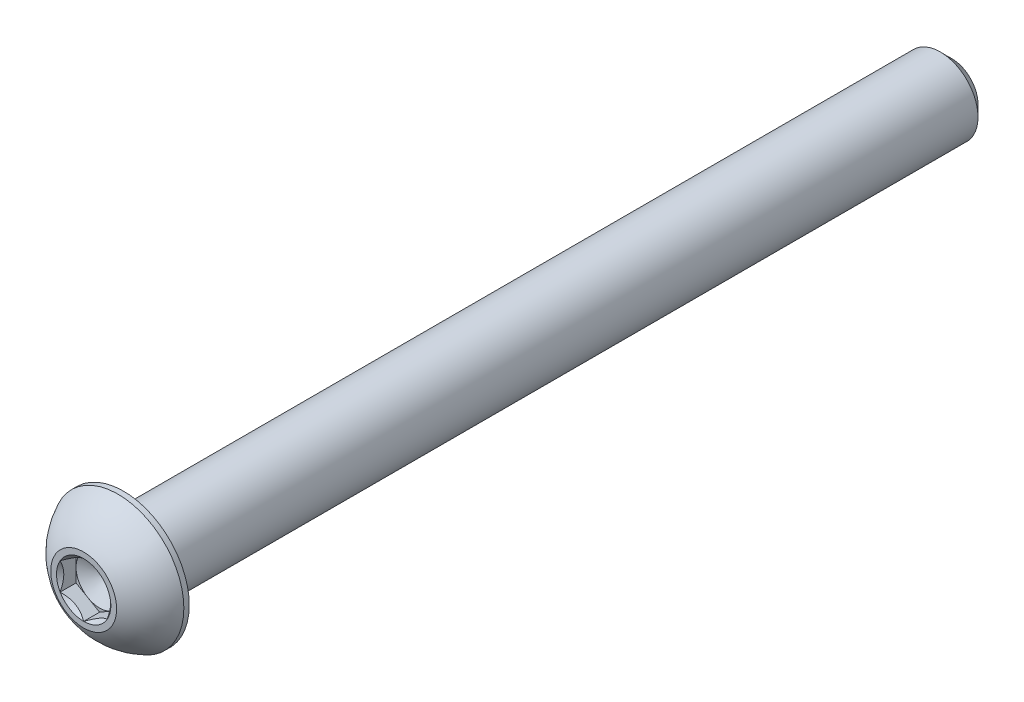
ISO-10303-21;
HEADER;
FILE_DESCRIPTION(('STEP AP214'),'2;1');
FILE_NAME('part.step','',(''),(''),'','','');
FILE_SCHEMA(('AUTOMOTIVE_DESIGN { 1 0 10303 214 1 1 1 1 }'));
ENDSEC;
DATA;
#1=APPLICATION_CONTEXT('core data for automotive mechanical design processes');
#2=APPLICATION_PROTOCOL_DEFINITION('international standard','automotive_design',2000,#1);
#3=PRODUCT_CONTEXT('',#1,'mechanical');
#4=PRODUCT('Part','Part','',(#3));
#5=PRODUCT_RELATED_PRODUCT_CATEGORY('part','',(#4));
#6=PRODUCT_DEFINITION_FORMATION('','',#4);
#7=PRODUCT_DEFINITION_CONTEXT('part definition',#1,'design');
#8=PRODUCT_DEFINITION('design','',#6,#7);
#9=PRODUCT_DEFINITION_SHAPE('','',#8);
#10=(LENGTH_UNIT() NAMED_UNIT(*) SI_UNIT(.MILLI.,.METRE.));
#11=(NAMED_UNIT(*) PLANE_ANGLE_UNIT() SI_UNIT($,.RADIAN.));
#12=(NAMED_UNIT(*) SI_UNIT($,.STERADIAN.) SOLID_ANGLE_UNIT());
#13=UNCERTAINTY_MEASURE_WITH_UNIT(LENGTH_MEASURE(1.E-05),#10,'distance_accuracy_value','');
#14=(GEOMETRIC_REPRESENTATION_CONTEXT(3) GLOBAL_UNCERTAINTY_ASSIGNED_CONTEXT((#13)) GLOBAL_UNIT_ASSIGNED_CONTEXT((#10,
#11,#12)) REPRESENTATION_CONTEXT('',''));
#15=CARTESIAN_POINT('',(0.,0.,0.));
#16=DIRECTION('',(0.,0.,1.));
#17=DIRECTION('',(1.,0.,0.));
#18=AXIS2_PLACEMENT_3D('',#15,#16,#17);
#19=CARTESIAN_POINT('',(0.,1.984375,36.6014));
#20=DIRECTION('',(0.,0.,-1.));
#21=DIRECTION('',(-1.,0.,0.));
#22=AXIS2_PLACEMENT_3D('',#19,#20,#21);
#23=PLANE('',#22);
#24=CARTESIAN_POINT('',(0.,0.,36.6014));
#25=DIRECTION('',(0.,0.,1.));
#26=DIRECTION('',(1.,0.,0.));
#27=AXIS2_PLACEMENT_3D('',#24,#25,#26);
#28=CIRCLE('',#27,2.778125);
#29=CARTESIAN_POINT('',(2.778125,0.,36.6014));
#30=VERTEX_POINT('',#29);
#31=EDGE_CURVE('E167',#30,#30,#28,.T.);
#32=ORIENTED_EDGE('',*,*,#31,.T.);
#33=EDGE_LOOP('',(#32));
#34=FACE_BOUND('',#33,.T.);
#35=CARTESIAN_POINT('',(0.,0.,36.6014));
#36=DIRECTION('',(0.,0.,1.));
#37=DIRECTION('',(1.,0.,0.));
#38=AXIS2_PLACEMENT_3D('',#35,#36,#37);
#39=CIRCLE('',#38,2.29135888084633);
#40=CARTESIAN_POINT('',(0.,2.29135888084633,36.6014));
#41=VERTEX_POINT('',#40);
#42=CARTESIAN_POINT('',(-1.984375,1.14567944042316,36.6014));
#43=VERTEX_POINT('',#42);
#44=EDGE_CURVE('E121',#41,#43,#39,.T.);
#45=ORIENTED_EDGE('',*,*,#44,.F.);
#46=CARTESIAN_POINT('',(0.,0.,36.6014));
#47=DIRECTION('',(0.,0.,1.));
#48=DIRECTION('',(1.,0.,0.));
#49=AXIS2_PLACEMENT_3D('',#46,#47,#48);
#50=CIRCLE('',#49,2.29135888084633);
#51=CARTESIAN_POINT('',(1.984375,1.14567944042317,36.6014));
#52=VERTEX_POINT('',#51);
#53=EDGE_CURVE('E106',#52,#41,#50,.T.);
#54=ORIENTED_EDGE('',*,*,#53,.F.);
#55=CARTESIAN_POINT('',(0.,0.,36.6014));
#56=DIRECTION('',(0.,0.,1.));
#57=DIRECTION('',(1.,0.,0.));
#58=AXIS2_PLACEMENT_3D('',#55,#56,#57);
#59=CIRCLE('',#58,2.29135888084633);
#60=CARTESIAN_POINT('',(1.984375,-1.14567944042316,36.6014));
#61=VERTEX_POINT('',#60);
#62=EDGE_CURVE('E117',#61,#52,#59,.T.);
#63=ORIENTED_EDGE('',*,*,#62,.F.);
#64=CARTESIAN_POINT('',(0.,0.,36.6014));
#65=DIRECTION('',(0.,0.,1.));
#66=DIRECTION('',(1.,0.,0.));
#67=AXIS2_PLACEMENT_3D('',#64,#65,#66);
#68=CIRCLE('',#67,2.29135888084633);
#69=CARTESIAN_POINT('',(0.,-2.29135888084633,36.6014));
#70=VERTEX_POINT('',#69);
#71=EDGE_CURVE('E138',#70,#61,#68,.T.);
#72=ORIENTED_EDGE('',*,*,#71,.F.);
#73=CARTESIAN_POINT('',(0.,0.,36.6014));
#74=DIRECTION('',(0.,0.,1.));
#75=DIRECTION('',(1.,0.,0.));
#76=AXIS2_PLACEMENT_3D('',#73,#74,#75);
#77=CIRCLE('',#76,2.29135888084633);
#78=CARTESIAN_POINT('',(-1.984375,-1.14567944042316,36.6014));
#79=VERTEX_POINT('',#78);
#80=EDGE_CURVE('E438',#79,#70,#77,.T.);
#81=ORIENTED_EDGE('',*,*,#80,.F.);
#82=CARTESIAN_POINT('',(0.,0.,36.6014));
#83=DIRECTION('',(0.,0.,1.));
#84=DIRECTION('',(1.,0.,0.));
#85=AXIS2_PLACEMENT_3D('',#82,#83,#84);
#86=CIRCLE('',#85,2.29135888084633);
#87=EDGE_CURVE('E447',#43,#79,#86,.T.);
#88=ORIENTED_EDGE('',*,*,#87,.F.);
#89=EDGE_LOOP('',(#45,#54,#63,#72,#81,#88));
#90=FACE_BOUND('',#89,.T.);
#91=ADVANCED_FACE('F33',(#34,#90),#23,.F.);
#92=CARTESIAN_POINT('',(0.,0.,-36.6014));
#93=DIRECTION('',(0.,0.,1.));
#94=DIRECTION('',(1.,0.,0.));
#95=AXIS2_PLACEMENT_3D('',#92,#93,#94);
#96=CONICAL_SURFACE('',#95,2.2225,0.78539816339745);
#97=CARTESIAN_POINT('',(0.,0.,-35.6489));
#98=DIRECTION('',(0.,0.,1.));
#99=DIRECTION('',(1.,0.,0.));
#100=AXIS2_PLACEMENT_3D('',#97,#98,#99);
#101=CIRCLE('',#100,3.175);
#102=CARTESIAN_POINT('',(3.175,0.,-35.6489));
#103=VERTEX_POINT('',#102);
#104=EDGE_CURVE('E11',#103,#103,#101,.T.);
#105=ORIENTED_EDGE('',*,*,#104,.F.);
#106=EDGE_LOOP('',(#105));
#107=FACE_BOUND('',#106,.T.);
#108=CARTESIAN_POINT('',(0.,0.,-36.6014));
#109=DIRECTION('',(0.,0.,1.));
#110=DIRECTION('',(1.,0.,0.));
#111=AXIS2_PLACEMENT_3D('',#108,#109,#110);
#112=CIRCLE('',#111,2.2225);
#113=CARTESIAN_POINT('',(2.2225,0.,-36.6014));
#114=VERTEX_POINT('',#113);
#115=EDGE_CURVE('E160',#114,#114,#112,.T.);
#116=ORIENTED_EDGE('',*,*,#115,.T.);
#117=EDGE_LOOP('',(#116));
#118=FACE_BOUND('',#117,.T.);
#119=ADVANCED_FACE('F35',(#107,#118),#96,.T.);
#120=CARTESIAN_POINT('',(0.,0.,36.6014));
#121=DIRECTION('',(0.,0.,1.));
#122=DIRECTION('',(1.,0.,0.));
#123=AXIS2_PLACEMENT_3D('',#120,#121,#122);
#124=CYLINDRICAL_SURFACE('',#123,3.175);
#125=CARTESIAN_POINT('',(0.,0.,33.2486));
#126=DIRECTION('',(0.,0.,1.));
#127=DIRECTION('',(1.,0.,0.));
#128=AXIS2_PLACEMENT_3D('',#125,#126,#127);
#129=CIRCLE('',#128,3.175);
#130=CARTESIAN_POINT('',(3.175,0.,33.2486));
#131=VERTEX_POINT('',#130);
#132=EDGE_CURVE('E41',#131,#131,#129,.T.);
#133=ORIENTED_EDGE('',*,*,#132,.F.);
#134=EDGE_LOOP('',(#133));
#135=FACE_BOUND('',#134,.T.);
#136=ORIENTED_EDGE('',*,*,#104,.T.);
#137=EDGE_LOOP('',(#136));
#138=FACE_BOUND('',#137,.T.);
#139=ADVANCED_FACE('F181',(#135,#138),#124,.T.);
#140=CARTESIAN_POINT('',(0.,5.5499,33.2486));
#141=DIRECTION('',(0.,0.,1.));
#142=DIRECTION('',(1.,0.,0.));
#143=AXIS2_PLACEMENT_3D('',#140,#141,#142);
#144=PLANE('',#143);
#145=CARTESIAN_POINT('',(0.,0.,33.2486));
#146=DIRECTION('',(0.,0.,1.));
#147=DIRECTION('',(1.,0.,0.));
#148=AXIS2_PLACEMENT_3D('',#145,#146,#147);
#149=CIRCLE('',#148,5.5499);
#150=CARTESIAN_POINT('',(5.5499,0.,33.2486));
#151=VERTEX_POINT('',#150);
#152=EDGE_CURVE('E174',#151,#151,#149,.T.);
#153=ORIENTED_EDGE('',*,*,#152,.F.);
#154=EDGE_LOOP('',(#153));
#155=FACE_BOUND('',#154,.T.);
#156=ORIENTED_EDGE('',*,*,#132,.T.);
#157=EDGE_LOOP('',(#156));
#158=FACE_BOUND('',#157,.T.);
#159=ADVANCED_FACE('F179',(#155,#158),#144,.F.);
#160=CARTESIAN_POINT('',(0.,0.,36.6014));
#161=DIRECTION('',(0.,0.,1.));
#162=DIRECTION('',(1.,0.,0.));
#163=AXIS2_PLACEMENT_3D('',#160,#161,#162);
#164=CYLINDRICAL_SURFACE('',#163,5.5499);
#165=CARTESIAN_POINT('',(0.,0.,33.7021714285714));
#166=DIRECTION('',(0.,0.,1.));
#167=DIRECTION('',(1.,0.,0.));
#168=AXIS2_PLACEMENT_3D('',#165,#166,#167);
#169=CIRCLE('',#168,5.5499);
#170=CARTESIAN_POINT('',(5.5499,0.,33.7021714285714));
#171=VERTEX_POINT('',#170);
#172=EDGE_CURVE('E171',#171,#171,#169,.T.);
#173=ORIENTED_EDGE('',*,*,#172,.F.);
#174=EDGE_LOOP('',(#173));
#175=FACE_BOUND('',#174,.T.);
#176=ORIENTED_EDGE('',*,*,#152,.T.);
#177=EDGE_LOOP('',(#176));
#178=FACE_BOUND('',#177,.T.);
#179=ADVANCED_FACE('F200',(#175,#178),#164,.T.);
#180=CARTESIAN_POINT('',(0.,0.,31.1708282068545));
#181=DIRECTION('',(0.,0.,1.));
#182=DIRECTION('',(0.,1.,0.));
#183=AXIS2_PLACEMENT_3D('',#180,#181,#182);
#184=SPHERICAL_SURFACE('',#183,6.09992528775001);
#185=ORIENTED_EDGE('',*,*,#31,.F.);
#186=EDGE_LOOP('',(#185));
#187=FACE_BOUND('',#186,.T.);
#188=ORIENTED_EDGE('',*,*,#172,.T.);
#189=EDGE_LOOP('',(#188));
#190=FACE_BOUND('',#189,.T.);
#191=ADVANCED_FACE('F192',(#187,#190),#184,.T.);
#192=CARTESIAN_POINT('',(0.,2.2225,-36.6014));
#193=DIRECTION('',(0.,0.,1.));
#194=DIRECTION('',(1.,0.,0.));
#195=AXIS2_PLACEMENT_3D('',#192,#193,#194);
#196=PLANE('',#195);
#197=ORIENTED_EDGE('',*,*,#115,.F.);
#198=EDGE_LOOP('',(#197));
#199=FACE_BOUND('',#198,.T.);
#200=ADVANCED_FACE('F190',(#199),#196,.F.);
#201=CARTESIAN_POINT('',(1.984375,1.14567944042317,36.6014));
#202=DIRECTION('',(-0.499999999999999,-0.866025403784439,0.));
#203=DIRECTION('',(0.866025403784439,-0.499999999999999,0.));
#204=AXIS2_PLACEMENT_3D('',#201,#202,#203);
#205=PLANE('',#204);
#206=CARTESIAN_POINT('',(1.984575,1.14556397036933,36.6015154787818));
#207=CARTESIAN_POINT('',(1.9163590048332,1.18494849354192,36.5621628522639));
#208=CARTESIAN_POINT('',(1.84700231489303,1.22499159714897,36.5251213104462));
#209=CARTESIAN_POINT('',(1.70557619954781,1.30664400291398,36.4572988584233));
#210=CARTESIAN_POINT('',(1.63349332126322,1.34826107209555,36.4265556890917));
#211=CARTESIAN_POINT('',(1.488141602734,1.43217992591557,36.3738918888112));
#212=CARTESIAN_POINT('',(1.41490978751306,1.47446033414663,36.35183887588));
#213=CARTESIAN_POINT('',(1.26683381740529,1.55995203534886,36.3178614929439));
#214=CARTESIAN_POINT('',(1.19199418724657,1.60316071596705,36.3059117560917));
#215=CARTESIAN_POINT('',(1.06301458545618,1.6776271237807,36.2951300990819));
#216=CARTESIAN_POINT('',(1.00904128422755,1.70878862377411,36.2935338990591));
#217=CARTESIAN_POINT('',(0.901182881480193,1.77106070163466,36.2962218388653));
#218=CARTESIAN_POINT('',(0.84729781751447,1.80217125782057,36.3005080403405));
#219=CARTESIAN_POINT('',(0.740036461751389,1.86409863044402,36.3147168730135));
#220=CARTESIAN_POINT('',(0.686660807239853,1.89491507894443,36.3246458104523));
#221=CARTESIAN_POINT('',(0.580832482591097,1.95601509066828,36.3495950842745));
#222=CARTESIAN_POINT('',(0.528379742028891,1.9862986945516,36.3646150303895));
#223=CARTESIAN_POINT('',(0.394017661036345,2.06387267818153,36.4092078516357));
#224=CARTESIAN_POINT('',(0.312941642841671,2.11068193911104,36.4421429959383));
#225=CARTESIAN_POINT('',(0.193726693270158,2.17951072233758,36.4977424412022));
#226=CARTESIAN_POINT('',(0.154440075613998,2.20219286161692,36.5172775920519));
#227=CARTESIAN_POINT('',(0.0765946381319478,2.24713694590236,36.5581287381194));
#228=CARTESIAN_POINT('',(0.0380353888983014,2.26939913882716,36.5794436395683));
#229=CARTESIAN_POINT('',(-0.000199999999999745,2.29147435090016,36.6015154787818));
#230=B_SPLINE_CURVE_WITH_KNOTS('',3,(#206,#207,#208,#209,#210,#211,#212,#213,#214,#215,#216,
#217,#218,#219,#220,#221,#222,#223,#224,#225,#226,#227,#228,#229),.UNSPECIFIED.,.F.,.F.,(4,2,2,
2,2,2,2,2,2,2,2,4),(0.,0.264339630306623,0.530219665093693,0.791876416371462,1.0528742441811,
1.23963984393201,1.42647091743853,1.61351120244035,1.80053715247541,2.09764209964317,
2.24579179873713,2.39385111134157),.UNSPECIFIED.);
#231=EDGE_CURVE('E103',#52,#41,#230,.T.);
#232=ORIENTED_EDGE('',*,*,#231,.T.);
#233=DIRECTION('',(0.,0.,-1.));
#234=VECTOR('',#233,1.);
#235=CARTESIAN_POINT('',(0.,2.29135888084633,36.6014));
#236=LINE('',#235,#234);
#237=CARTESIAN_POINT('',(0.,2.29135888084633,35.26028));
#238=VERTEX_POINT('',#237);
#239=EDGE_CURVE('E158',#41,#238,#236,.T.);
#240=ORIENTED_EDGE('',*,*,#239,.T.);
#241=DIRECTION('',(-0.866025403784439,0.499999999999999,0.));
#242=VECTOR('',#241,1.);
#243=CARTESIAN_POINT('',(1.984375,1.14567944042317,35.26028));
#244=LINE('',#243,#242);
#245=CARTESIAN_POINT('',(0.992187499999999,1.71851916063475,35.26028));
#246=VERTEX_POINT('',#245);
#247=EDGE_CURVE('E474',#246,#238,#244,.T.);
#248=ORIENTED_EDGE('',*,*,#247,.F.);
#249=CARTESIAN_POINT('',(1.984375,1.14567944042317,35.26028));
#250=VERTEX_POINT('',#249);
#251=EDGE_CURVE('E48',#250,#246,#244,.T.);
#252=ORIENTED_EDGE('',*,*,#251,.F.);
#253=DIRECTION('',(0.,0.,-1.));
#254=VECTOR('',#253,1.);
#255=CARTESIAN_POINT('',(1.984375,1.14567944042317,36.6014));
#256=LINE('',#255,#254);
#257=EDGE_CURVE('E134',#52,#250,#256,.T.);
#258=ORIENTED_EDGE('',*,*,#257,.F.);
#259=EDGE_LOOP('',(#232,#240,#248,#252,#258));
#260=FACE_BOUND('',#259,.T.);
#261=ADVANCED_FACE('F140',(#260),#205,.T.);
#262=CARTESIAN_POINT('',(0.,2.29135888084633,36.6014));
#263=DIRECTION('',(0.5,-0.866025403784438,0.));
#264=DIRECTION('',(0.866025403784438,0.5,0.));
#265=AXIS2_PLACEMENT_3D('',#262,#263,#264);
#266=PLANE('',#265);
#267=CARTESIAN_POINT('',(0.000199999999998038,2.29147435090017,36.6015154787818));
#268=CARTESIAN_POINT('',(-0.0680159951668046,2.25208982772757,36.5621628522639));
#269=CARTESIAN_POINT('',(-0.137372685106967,2.21204672412052,36.5251213104462));
#270=CARTESIAN_POINT('',(-0.278798800452188,2.13039431835551,36.4572988584233));
#271=CARTESIAN_POINT('',(-0.350881678736783,2.08877724917394,36.4265556890917));
#272=CARTESIAN_POINT('',(-0.496233397266005,2.00485839535392,36.3738918888112));
#273=CARTESIAN_POINT('',(-0.569465212486941,1.96257798712287,36.35183887588));
#274=CARTESIAN_POINT('',(-0.717541182594711,1.87708628592063,36.3178614929439));
#275=CARTESIAN_POINT('',(-0.79238081275343,1.83387760530244,36.3059117560917));
#276=CARTESIAN_POINT('',(-0.921360414543822,1.75941119748879,36.2951300990819));
#277=CARTESIAN_POINT('',(-0.975333715772448,1.72824969749539,36.2935338990591));
#278=CARTESIAN_POINT('',(-1.08319211851981,1.66597761963484,36.2962218388653));
#279=CARTESIAN_POINT('',(-1.13707718248553,1.63486706344893,36.3005080403405));
#280=CARTESIAN_POINT('',(-1.24433853824861,1.57293969082547,36.3147168730135));
#281=CARTESIAN_POINT('',(-1.29771419276015,1.54212324232506,36.3246458104523));
#282=CARTESIAN_POINT('',(-1.4035425174089,1.48102323060121,36.3495950842745));
#283=CARTESIAN_POINT('',(-1.45599525797111,1.45073962671789,36.3646150303895));
#284=CARTESIAN_POINT('',(-1.59035733896365,1.37316564308797,36.4092078516357));
#285=CARTESIAN_POINT('',(-1.67143335715833,1.32635638215845,36.4421429959383));
#286=CARTESIAN_POINT('',(-1.79064830672984,1.25752759893191,36.4977424412022));
#287=CARTESIAN_POINT('',(-1.829934924386,1.23484545965257,36.5172775920519));
#288=CARTESIAN_POINT('',(-1.90778036186805,1.18990137536713,36.5581287381194));
#289=CARTESIAN_POINT('',(-1.9463396111017,1.16763918244233,36.5794436395683));
#290=CARTESIAN_POINT('',(-1.984575,1.14556397036933,36.6015154787818));
#291=B_SPLINE_CURVE_WITH_KNOTS('',3,(#267,#268,#269,#270,#271,#272,#273,#274,#275,#276,#277,
#278,#279,#280,#281,#282,#283,#284,#285,#286,#287,#288,#289,#290),.UNSPECIFIED.,.F.,.F.,(4,2,2,
2,2,2,2,2,2,2,2,4),(0.,0.264339630306623,0.530219665093693,0.791876416371462,1.0528742441811,
1.23963984393201,1.42647091743853,1.61351120244035,1.80053715247541,2.09764209964316,
2.24579179873713,2.39385111134157),.UNSPECIFIED.);
#292=EDGE_CURVE('E462',#41,#43,#291,.T.);
#293=ORIENTED_EDGE('',*,*,#292,.T.);
#294=DIRECTION('',(0.,0.,-1.));
#295=VECTOR('',#294,1.);
#296=CARTESIAN_POINT('',(-1.984375,1.14567944042316,36.6014));
#297=LINE('',#296,#295);
#298=CARTESIAN_POINT('',(-1.984375,1.14567944042316,35.26028));
#299=VERTEX_POINT('',#298);
#300=EDGE_CURVE('E155',#43,#299,#297,.T.);
#301=ORIENTED_EDGE('',*,*,#300,.T.);
#302=DIRECTION('',(-0.866025403784438,-0.5,0.));
#303=VECTOR('',#302,1.);
#304=CARTESIAN_POINT('',(0.,2.29135888084633,35.26028));
#305=LINE('',#304,#303);
#306=CARTESIAN_POINT('',(-0.992187500000001,1.71851916063475,35.26028));
#307=VERTEX_POINT('',#306);
#308=EDGE_CURVE('E476',#307,#299,#305,.T.);
#309=ORIENTED_EDGE('',*,*,#308,.F.);
#310=EDGE_CURVE('E477',#238,#307,#305,.T.);
#311=ORIENTED_EDGE('',*,*,#310,.F.);
#312=ORIENTED_EDGE('',*,*,#239,.F.);
#313=EDGE_LOOP('',(#293,#301,#309,#311,#312));
#314=FACE_BOUND('',#313,.T.);
#315=ADVANCED_FACE('F198',(#314),#266,.T.);
#316=CARTESIAN_POINT('',(-1.984375,1.14567944042316,36.6014));
#317=DIRECTION('',(1.,0.,0.));
#318=DIRECTION('',(0.,1.,0.));
#319=AXIS2_PLACEMENT_3D('',#316,#317,#318);
#320=PLANE('',#319);
#321=CARTESIAN_POINT('',(-1.984375,-2.24664989492636,37.3075700833169));
#322=CARTESIAN_POINT('',(-1.984375,-2.19177035879914,37.2664466992886));
#323=CARTESIAN_POINT('',(-1.984375,-2.1365793309425,37.2257329661326));
#324=CARTESIAN_POINT('',(-1.984375,-2.0254530694156,37.1453048670617));
#325=CARTESIAN_POINT('',(-1.984375,-1.96951764844329,37.1055907602265));
#326=CARTESIAN_POINT('',(-1.984375,-1.85637247000972,37.0270599960499));
#327=CARTESIAN_POINT('',(-1.984375,-1.79915619451492,36.9882526850202));
#328=CARTESIAN_POINT('',(-1.984375,-1.68374612486123,36.9121311665578));
#329=CARTESIAN_POINT('',(-1.984375,-1.62555240093273,36.8748168524981));
#330=CARTESIAN_POINT('',(-1.984375,-1.44283684202776,36.761567942359));
#331=CARTESIAN_POINT('',(-1.984375,-1.31636516124235,36.6887214191006));
#332=CARTESIAN_POINT('',(-1.984375,-1.05716498260296,36.5557117557776));
#333=CARTESIAN_POINT('',(-1.984375,-0.924459462264121,36.4955059196546));
#334=CARTESIAN_POINT('',(-1.984375,-0.724893074141585,36.4218618396154));
#335=CARTESIAN_POINT('',(-1.984375,-0.66090757224881,36.4006629174856));
#336=CARTESIAN_POINT('',(-1.984375,-0.531425551080245,36.3634071147974));
#337=CARTESIAN_POINT('',(-1.984375,-0.465928924835294,36.3473505994633));
#338=CARTESIAN_POINT('',(-1.984375,-0.334891945890405,36.3214708434592));
#339=CARTESIAN_POINT('',(-1.984375,-0.269372555502921,36.3115431015484));
#340=CARTESIAN_POINT('',(-1.984375,-0.137675185771462,36.2981085903106));
#341=CARTESIAN_POINT('',(-1.984375,-0.0714973135780648,36.2946007929468));
#342=CARTESIAN_POINT('',(-1.984375,0.0586431546448461,36.2942516482373));
#343=CARTESIAN_POINT('',(-1.984375,0.122605247687117,36.2971896245911));
#344=CARTESIAN_POINT('',(-1.984375,0.249962419599663,36.3090917091826));
#345=CARTESIAN_POINT('',(-1.984375,0.31335744162457,36.3180564148524));
#346=CARTESIAN_POINT('',(-1.984375,0.440194078343455,36.3416811503476));
#347=CARTESIAN_POINT('',(-1.984375,0.503617615772965,36.3564367997364));
#348=CARTESIAN_POINT('',(-1.984375,0.62908370104763,36.3908707574727));
#349=CARTESIAN_POINT('',(-1.984375,0.691126376772749,36.410548607898));
#350=CARTESIAN_POINT('',(-1.984375,0.888252191671365,36.4804251863326));
#351=CARTESIAN_POINT('',(-1.984375,1.02048040542615,36.5386555893404));
#352=CARTESIAN_POINT('',(-1.984375,1.27871806100267,36.6680691802767));
#353=CARTESIAN_POINT('',(-1.984375,1.40470281207756,36.7392992719574));
#354=CARTESIAN_POINT('',(-1.984375,1.58677859920221,36.8504129319412));
#355=CARTESIAN_POINT('',(-1.984375,1.64484387516129,36.8871238248926));
#356=CARTESIAN_POINT('',(-1.984375,1.75997827817989,36.9620874476375));
#357=CARTESIAN_POINT('',(-1.984375,1.81704732901584,37.0003402946748));
#358=CARTESIAN_POINT('',(-1.984375,1.92985499213404,37.0777867819938));
#359=CARTESIAN_POINT('',(-1.984375,1.98560066211378,37.1169701932287));
#360=CARTESIAN_POINT('',(-1.984375,2.09633159947627,37.1963666099261));
#361=CARTESIAN_POINT('',(-1.984375,2.15131707145809,37.2365793297131));
#362=CARTESIAN_POINT('',(-1.984375,2.20598450458983,37.27721347261));
#363=B_SPLINE_CURVE_WITH_KNOTS('',3,(#321,#322,#323,#324,#325,#326,#327,#328,#329,#330,#331,
#332,#333,#334,#335,#336,#337,#338,#339,#340,#341,#342,#343,#344,#345,#346,#347,#348,#349,#350,
#351,#352,#353,#354,#355,#356,#357,#358,#359,#360,#361,#362),.UNSPECIFIED.,.F.,.F.,(4,2,2,2,2,2,
2,2,2,2,2,2,2,2,2,2,2,2,2,2,4),(0.,0.20573621035677,0.411525204809811,0.618909845914794,
0.826279649489807,1.26374370453551,1.69970549535383,1.90175047418287,2.10380979948049,
2.3023211047986,2.50080061937433,2.69259135253524,2.88440110079442,3.07952109080018,
3.27462293514803,3.7067989701189,4.14056631296022,4.34663769336144,4.55272477227101,
4.7571295110882,4.96147812147719),.UNSPECIFIED.);
#364=EDGE_CURVE('E455',#43,#79,#363,.F.);
#365=ORIENTED_EDGE('',*,*,#364,.T.);
#366=DIRECTION('',(0.,0.,-1.));
#367=VECTOR('',#366,1.);
#368=CARTESIAN_POINT('',(-1.984375,-1.14567944042316,36.6014));
#369=LINE('',#368,#367);
#370=CARTESIAN_POINT('',(-1.984375,-1.14567944042316,35.26028));
#371=VERTEX_POINT('',#370);
#372=EDGE_CURVE('E152',#79,#371,#369,.T.);
#373=ORIENTED_EDGE('',*,*,#372,.T.);
#374=DIRECTION('',(0.,-1.,0.));
#375=VECTOR('',#374,1.);
#376=CARTESIAN_POINT('',(-1.984375,1.14567944042316,35.26028));
#377=LINE('',#376,#375);
#378=CARTESIAN_POINT('',(-1.984375,0.,35.26028));
#379=VERTEX_POINT('',#378);
#380=EDGE_CURVE('E480',#379,#371,#377,.T.);
#381=ORIENTED_EDGE('',*,*,#380,.F.);
#382=EDGE_CURVE('E481',#299,#379,#377,.T.);
#383=ORIENTED_EDGE('',*,*,#382,.F.);
#384=ORIENTED_EDGE('',*,*,#300,.F.);
#385=EDGE_LOOP('',(#365,#373,#381,#383,#384));
#386=FACE_BOUND('',#385,.T.);
#387=ADVANCED_FACE('F319',(#386),#320,.T.);
#388=CARTESIAN_POINT('',(-1.984375,-1.14567944042316,36.6014));
#389=DIRECTION('',(0.499999999999999,0.866025403784439,0.));
#390=DIRECTION('',(-0.866025403784439,0.499999999999999,0.));
#391=AXIS2_PLACEMENT_3D('',#388,#389,#390);
#392=PLANE('',#391);
#393=CARTESIAN_POINT('',(-1.984575,-1.14556397036933,36.6015154787818));
#394=CARTESIAN_POINT('',(-1.9163590048332,-1.18494849354192,36.5621628522639));
#395=CARTESIAN_POINT('',(-1.84700231489303,-1.22499159714897,36.5251213104462));
#396=CARTESIAN_POINT('',(-1.70557619954781,-1.30664400291398,36.4572988584233));
#397=CARTESIAN_POINT('',(-1.63349332126321,-1.34826107209555,36.4265556890917));
#398=CARTESIAN_POINT('',(-1.48814160273399,-1.43217992591557,36.3738918888112));
#399=CARTESIAN_POINT('',(-1.41490978751306,-1.47446033414663,36.35183887588));
#400=CARTESIAN_POINT('',(-1.26683381740529,-1.55995203534886,36.3178614929439));
#401=CARTESIAN_POINT('',(-1.19199418724657,-1.60316071596705,36.3059117560917));
#402=CARTESIAN_POINT('',(-1.06301458545618,-1.6776271237807,36.2951300990819));
#403=CARTESIAN_POINT('',(-1.00904128422755,-1.7087886237741,36.2935338990591));
#404=CARTESIAN_POINT('',(-0.901182881480194,-1.77106070163465,36.2962218388653));
#405=CARTESIAN_POINT('',(-0.847297817514471,-1.80217125782056,36.3005080403404));
#406=CARTESIAN_POINT('',(-0.74003646175139,-1.86409863044402,36.3147168730135));
#407=CARTESIAN_POINT('',(-0.686660807239854,-1.89491507894443,36.3246458104523));
#408=CARTESIAN_POINT('',(-0.580832482591098,-1.95601509066828,36.3495950842745));
#409=CARTESIAN_POINT('',(-0.528379742028893,-1.9862986945516,36.3646150303895));
#410=CARTESIAN_POINT('',(-0.394017661036347,-2.06387267818152,36.4092078516357));
#411=CARTESIAN_POINT('',(-0.312941642841672,-2.11068193911104,36.4421429959383));
#412=CARTESIAN_POINT('',(-0.193726693270161,-2.17951072233758,36.4977424412022));
#413=CARTESIAN_POINT('',(-0.154440075614,-2.20219286161692,36.5172775920519));
#414=CARTESIAN_POINT('',(-0.0765946381319494,-2.24713694590236,36.5581287381194));
#415=CARTESIAN_POINT('',(-0.0380353888983026,-2.26939913882716,36.5794436395683));
#416=CARTESIAN_POINT('',(0.000200000000000592,-2.29147435090016,36.6015154787818));
#417=B_SPLINE_CURVE_WITH_KNOTS('',3,(#393,#394,#395,#396,#397,#398,#399,#400,#401,#402,#403,
#404,#405,#406,#407,#408,#409,#410,#411,#412,#413,#414,#415,#416),.UNSPECIFIED.,.F.,.F.,(4,2,2,
2,2,2,2,2,2,2,2,4),(0.,0.264339630306631,0.530219665093698,0.791876416371465,1.0528742441811,
1.23963984393201,1.42647091743853,1.61351120244035,1.80053715247541,2.09764209964316,
2.24579179873713,2.39385111134157),.UNSPECIFIED.);
#418=EDGE_CURVE('E440',#79,#70,#417,.T.);
#419=ORIENTED_EDGE('',*,*,#418,.T.);
#420=DIRECTION('',(0.,0.,-1.));
#421=VECTOR('',#420,1.);
#422=CARTESIAN_POINT('',(0.,-2.29135888084633,36.6014));
#423=LINE('',#422,#421);
#424=CARTESIAN_POINT('',(0.,-2.29135888084633,35.26028));
#425=VERTEX_POINT('',#424);
#426=EDGE_CURVE('E143',#70,#425,#423,.T.);
#427=ORIENTED_EDGE('',*,*,#426,.T.);
#428=DIRECTION('',(0.866025403784439,-0.499999999999999,0.));
#429=VECTOR('',#428,1.);
#430=CARTESIAN_POINT('',(-1.984375,-1.14567944042316,35.26028));
#431=LINE('',#430,#429);
#432=CARTESIAN_POINT('',(-0.992187499999998,-1.71851916063475,35.26028));
#433=VERTEX_POINT('',#432);
#434=EDGE_CURVE('E484',#433,#425,#431,.T.);
#435=ORIENTED_EDGE('',*,*,#434,.F.);
#436=EDGE_CURVE('E485',#371,#433,#431,.T.);
#437=ORIENTED_EDGE('',*,*,#436,.F.);
#438=ORIENTED_EDGE('',*,*,#372,.F.);
#439=EDGE_LOOP('',(#419,#427,#435,#437,#438));
#440=FACE_BOUND('',#439,.T.);
#441=ADVANCED_FACE('F329',(#440),#392,.T.);
#442=CARTESIAN_POINT('',(0.,-2.29135888084633,36.6014));
#443=DIRECTION('',(-0.5,0.866025403784438,0.));
#444=DIRECTION('',(-0.866025403784438,-0.5,0.));
#445=AXIS2_PLACEMENT_3D('',#442,#443,#444);
#446=PLANE('',#445);
#447=CARTESIAN_POINT('',(-0.000199999999998923,-2.29147435090016,36.6015154787818));
#448=CARTESIAN_POINT('',(0.0680159951668029,-2.25208982772757,36.5621628522639));
#449=CARTESIAN_POINT('',(0.137372685106967,-2.21204672412052,36.5251213104462));
#450=CARTESIAN_POINT('',(0.278798800452189,-2.13039431835551,36.4572988584233));
#451=CARTESIAN_POINT('',(0.350881678736784,-2.08877724917394,36.4265556890917));
#452=CARTESIAN_POINT('',(0.496233397266005,-2.00485839535392,36.3738918888112));
#453=CARTESIAN_POINT('',(0.569465212486939,-1.96257798712286,36.35183887588));
#454=CARTESIAN_POINT('',(0.717541182594706,-1.87708628592063,36.3178614929439));
#455=CARTESIAN_POINT('',(0.792380812753423,-1.83387760530244,36.3059117560917));
#456=CARTESIAN_POINT('',(0.921360414543814,-1.75941119748879,36.2951300990819));
#457=CARTESIAN_POINT('',(0.97533371577244,-1.72824969749539,36.2935338990591));
#458=CARTESIAN_POINT('',(1.0831921185198,-1.66597761963484,36.2962218388653));
#459=CARTESIAN_POINT('',(1.13707718248552,-1.63486706344893,36.3005080403404));
#460=CARTESIAN_POINT('',(1.2443385382486,-1.57293969082547,36.3147168730135));
#461=CARTESIAN_POINT('',(1.29771419276014,-1.54212324232506,36.3246458104523));
#462=CARTESIAN_POINT('',(1.40354251740889,-1.48102323060122,36.3495950842745));
#463=CARTESIAN_POINT('',(1.4559952579711,-1.45073962671789,36.3646150303895));
#464=CARTESIAN_POINT('',(1.59035733896365,-1.37316564308797,36.4092078516357));
#465=CARTESIAN_POINT('',(1.67143335715832,-1.32635638215845,36.4421429959383));
#466=CARTESIAN_POINT('',(1.79064830672984,-1.25752759893191,36.4977424412022));
#467=CARTESIAN_POINT('',(1.829934924386,-1.23484545965257,36.5172775920519));
#468=CARTESIAN_POINT('',(1.90778036186805,-1.18990137536713,36.5581287381194));
#469=CARTESIAN_POINT('',(1.9463396111017,-1.16763918244233,36.5794436395683));
#470=CARTESIAN_POINT('',(1.984575,-1.14556397036932,36.6015154787818));
#471=B_SPLINE_CURVE_WITH_KNOTS('',3,(#447,#448,#449,#450,#451,#452,#453,#454,#455,#456,#457,
#458,#459,#460,#461,#462,#463,#464,#465,#466,#467,#468,#469,#470),.UNSPECIFIED.,.F.,.F.,(4,2,2,
2,2,2,2,2,2,2,2,4),(0.,0.264339630306629,0.530219665093695,0.791876416371459,1.05287424418109,
1.239639843932,1.42647091743852,1.61351120244034,1.8005371524754,2.09764209964316,
2.24579179873713,2.39385111134157),.UNSPECIFIED.);
#472=EDGE_CURVE('E431',#70,#61,#471,.T.);
#473=ORIENTED_EDGE('',*,*,#472,.T.);
#474=DIRECTION('',(0.,0.,-1.));
#475=VECTOR('',#474,1.);
#476=CARTESIAN_POINT('',(1.984375,-1.14567944042316,36.6014));
#477=LINE('',#476,#475);
#478=CARTESIAN_POINT('',(1.984375,-1.14567944042316,35.26028));
#479=VERTEX_POINT('',#478);
#480=EDGE_CURVE('E137',#61,#479,#477,.T.);
#481=ORIENTED_EDGE('',*,*,#480,.T.);
#482=DIRECTION('',(0.866025403784438,0.5,0.));
#483=VECTOR('',#482,1.);
#484=CARTESIAN_POINT('',(0.,-2.29135888084633,35.26028));
#485=LINE('',#484,#483);
#486=CARTESIAN_POINT('',(0.9921875,-1.71851916063474,35.26028));
#487=VERTEX_POINT('',#486);
#488=EDGE_CURVE('E487',#487,#479,#485,.T.);
#489=ORIENTED_EDGE('',*,*,#488,.F.);
#490=EDGE_CURVE('E488',#425,#487,#485,.T.);
#491=ORIENTED_EDGE('',*,*,#490,.F.);
#492=ORIENTED_EDGE('',*,*,#426,.F.);
#493=EDGE_LOOP('',(#473,#481,#489,#491,#492));
#494=FACE_BOUND('',#493,.T.);
#495=ADVANCED_FACE('F339',(#494),#446,.T.);
#496=CARTESIAN_POINT('',(1.984375,-1.14567944042316,36.6014));
#497=DIRECTION('',(-1.,0.,0.));
#498=DIRECTION('',(0.,-1.,0.));
#499=AXIS2_PLACEMENT_3D('',#496,#497,#498);
#500=PLANE('',#499);
#501=CARTESIAN_POINT('',(1.984375,-2.24664989492635,37.3075700833169));
#502=CARTESIAN_POINT('',(1.984375,-2.19177035879913,37.2664466992886));
#503=CARTESIAN_POINT('',(1.984375,-2.1365793309425,37.2257329661326));
#504=CARTESIAN_POINT('',(1.984375,-2.0254530694156,37.1453048670617));
#505=CARTESIAN_POINT('',(1.984375,-1.96951764844329,37.1055907602265));
#506=CARTESIAN_POINT('',(1.984375,-1.85637247000971,37.0270599960499));
#507=CARTESIAN_POINT('',(1.984375,-1.79915619451491,36.9882526850202));
#508=CARTESIAN_POINT('',(1.984375,-1.68374612486123,36.9121311665578));
#509=CARTESIAN_POINT('',(1.984375,-1.62555240093272,36.8748168524981));
#510=CARTESIAN_POINT('',(1.984375,-1.44283684202776,36.761567942359));
#511=CARTESIAN_POINT('',(1.984375,-1.31636516124235,36.6887214191006));
#512=CARTESIAN_POINT('',(1.984375,-1.05716498260295,36.5557117557776));
#513=CARTESIAN_POINT('',(1.984375,-0.924459462264117,36.4955059196546));
#514=CARTESIAN_POINT('',(1.984375,-0.724893074141585,36.4218618396154));
#515=CARTESIAN_POINT('',(1.984375,-0.66090757224881,36.4006629174856));
#516=CARTESIAN_POINT('',(1.984375,-0.531425551080245,36.3634071147974));
#517=CARTESIAN_POINT('',(1.984375,-0.465928924835292,36.3473505994633));
#518=CARTESIAN_POINT('',(1.984375,-0.334891945890402,36.3214708434592));
#519=CARTESIAN_POINT('',(1.984375,-0.269372555502918,36.3115431015484));
#520=CARTESIAN_POINT('',(1.984375,-0.137675185771458,36.2981085903106));
#521=CARTESIAN_POINT('',(1.984375,-0.0714973135780599,36.2946007929468));
#522=CARTESIAN_POINT('',(1.984375,0.0586431546448513,36.2942516482373));
#523=CARTESIAN_POINT('',(1.984375,0.122605247687121,36.2971896245911));
#524=CARTESIAN_POINT('',(1.984375,0.249962419599666,36.3090917091826));
#525=CARTESIAN_POINT('',(1.984375,0.313357441624572,36.3180564148524));
#526=CARTESIAN_POINT('',(1.984375,0.440194078343456,36.3416811503476));
#527=CARTESIAN_POINT('',(1.984375,0.503617615772966,36.3564367997364));
#528=CARTESIAN_POINT('',(1.984375,0.62908370104763,36.3908707574727));
#529=CARTESIAN_POINT('',(1.984375,0.691126376772749,36.410548607898));
#530=CARTESIAN_POINT('',(1.984375,0.888252191671362,36.4804251863326));
#531=CARTESIAN_POINT('',(1.984375,1.02048040542615,36.5386555893404));
#532=CARTESIAN_POINT('',(1.984375,1.27871806100267,36.6680691802767));
#533=CARTESIAN_POINT('',(1.984375,1.40470281207756,36.7392992719574));
#534=CARTESIAN_POINT('',(1.984375,1.5867785992022,36.8504129319412));
#535=CARTESIAN_POINT('',(1.984375,1.64484387516129,36.8871238248926));
#536=CARTESIAN_POINT('',(1.984375,1.75997827817988,36.9620874476374));
#537=CARTESIAN_POINT('',(1.984375,1.81704732901584,37.0003402946748));
#538=CARTESIAN_POINT('',(1.984375,1.92985499213404,37.0777867819938));
#539=CARTESIAN_POINT('',(1.984375,1.98560066211378,37.1169701932287));
#540=CARTESIAN_POINT('',(1.984375,2.09633159947627,37.1963666099261));
#541=CARTESIAN_POINT('',(1.984375,2.15131707145809,37.2365793297131));
#542=CARTESIAN_POINT('',(1.984375,2.20598450458983,37.27721347261));
#543=B_SPLINE_CURVE_WITH_KNOTS('',3,(#501,#502,#503,#504,#505,#506,#507,#508,#509,#510,#511,
#512,#513,#514,#515,#516,#517,#518,#519,#520,#521,#522,#523,#524,#525,#526,#527,#528,#529,#530,
#531,#532,#533,#534,#535,#536,#537,#538,#539,#540,#541,#542),.UNSPECIFIED.,.F.,.F.,(4,2,2,2,2,2,
2,2,2,2,2,2,2,2,2,2,2,2,2,2,4),(0.,0.205736210356761,0.411525204809804,0.618909845914792,
0.826279649489803,1.26374370453551,1.69970549535382,1.90175047418286,2.10380979948048,
2.30232110479859,2.50080061937433,2.69259135253523,2.88440110079441,3.07952109080017,
3.27462293514802,3.70679897011888,4.14056631296021,4.34663769336142,4.552724772271,
4.75712951108819,4.96147812147718),.UNSPECIFIED.);
#544=EDGE_CURVE('E127',#61,#52,#543,.T.);
#545=ORIENTED_EDGE('',*,*,#544,.T.);
#546=ORIENTED_EDGE('',*,*,#257,.T.);
#547=DIRECTION('',(0.,1.,0.));
#548=VECTOR('',#547,1.);
#549=CARTESIAN_POINT('',(1.984375,-1.14567944042316,35.26028));
#550=LINE('',#549,#548);
#551=CARTESIAN_POINT('',(1.984375,0.,35.26028));
#552=VERTEX_POINT('',#551);
#553=EDGE_CURVE('E146',#552,#250,#550,.T.);
#554=ORIENTED_EDGE('',*,*,#553,.F.);
#555=EDGE_CURVE('E141',#479,#552,#550,.T.);
#556=ORIENTED_EDGE('',*,*,#555,.F.);
#557=ORIENTED_EDGE('',*,*,#480,.F.);
#558=EDGE_LOOP('',(#545,#546,#554,#556,#557));
#559=FACE_BOUND('',#558,.T.);
#560=ADVANCED_FACE('F132',(#559),#500,.T.);
#561=CARTESIAN_POINT('',(0.,0.,35.26028));
#562=DIRECTION('',(0.,0.,1.));
#563=DIRECTION('',(1.,0.,0.));
#564=AXIS2_PLACEMENT_3D('',#561,#562,#563);
#565=PLANE('',#564);
#566=CARTESIAN_POINT('',(0.,0.,35.26028));
#567=DIRECTION('',(0.,0.,1.));
#568=DIRECTION('',(1.,0.,0.));
#569=AXIS2_PLACEMENT_3D('',#566,#567,#568);
#570=CIRCLE('',#569,1.984375);
#571=EDGE_CURVE('E163',#487,#552,#570,.T.);
#572=ORIENTED_EDGE('',*,*,#571,.F.);
#573=ORIENTED_EDGE('',*,*,#488,.T.);
#574=ORIENTED_EDGE('',*,*,#555,.T.);
#575=EDGE_LOOP('',(#572,#573,#574));
#576=FACE_BOUND('',#575,.T.);
#577=ADVANCED_FACE('F241',(#576),#565,.T.);
#578=EDGE_CURVE('E500',#433,#487,#570,.T.);
#579=ORIENTED_EDGE('',*,*,#578,.F.);
#580=ORIENTED_EDGE('',*,*,#434,.T.);
#581=ORIENTED_EDGE('',*,*,#490,.T.);
#582=EDGE_LOOP('',(#579,#580,#581));
#583=FACE_BOUND('',#582,.T.);
#584=ADVANCED_FACE('F246',(#583),#565,.T.);
#585=EDGE_CURVE('E501',#379,#433,#570,.T.);
#586=ORIENTED_EDGE('',*,*,#585,.F.);
#587=ORIENTED_EDGE('',*,*,#380,.T.);
#588=ORIENTED_EDGE('',*,*,#436,.T.);
#589=EDGE_LOOP('',(#586,#587,#588));
#590=FACE_BOUND('',#589,.T.);
#591=ADVANCED_FACE('F259',(#590),#565,.T.);
#592=EDGE_CURVE('E502',#307,#379,#570,.T.);
#593=ORIENTED_EDGE('',*,*,#592,.F.);
#594=ORIENTED_EDGE('',*,*,#308,.T.);
#595=ORIENTED_EDGE('',*,*,#382,.T.);
#596=EDGE_LOOP('',(#593,#594,#595));
#597=FACE_BOUND('',#596,.T.);
#598=ADVANCED_FACE('F268',(#597),#565,.T.);
#599=EDGE_CURVE('E168',#246,#307,#570,.T.);
#600=ORIENTED_EDGE('',*,*,#599,.F.);
#601=ORIENTED_EDGE('',*,*,#247,.T.);
#602=ORIENTED_EDGE('',*,*,#310,.T.);
#603=EDGE_LOOP('',(#600,#601,#602));
#604=FACE_BOUND('',#603,.T.);
#605=ADVANCED_FACE('F277',(#604),#565,.T.);
#606=EDGE_CURVE('E164',#552,#246,#570,.T.);
#607=ORIENTED_EDGE('',*,*,#606,.F.);
#608=ORIENTED_EDGE('',*,*,#553,.T.);
#609=ORIENTED_EDGE('',*,*,#251,.T.);
#610=EDGE_LOOP('',(#607,#608,#609));
#611=FACE_BOUND('',#610,.T.);
#612=ADVANCED_FACE('F249',(#611),#565,.T.);
#613=CARTESIAN_POINT('',(0.,0.,35.26028));
#614=DIRECTION('',(0.,0.,1.));
#615=DIRECTION('',(1.,0.,0.));
#616=AXIS2_PLACEMENT_3D('',#613,#614,#615);
#617=CONICAL_SURFACE('',#616,1.984375,1.0471975511966);
#618=CARTESIAN_POINT('',(0.,0.,34.1146005595768));
#619=VERTEX_POINT('',#618);
#620=VERTEX_LOOP('',#619);
#621=FACE_BOUND('',#620,.T.);
#622=ORIENTED_EDGE('',*,*,#606,.T.);
#623=ORIENTED_EDGE('',*,*,#599,.T.);
#624=ORIENTED_EDGE('',*,*,#592,.T.);
#625=ORIENTED_EDGE('',*,*,#585,.T.);
#626=ORIENTED_EDGE('',*,*,#578,.T.);
#627=ORIENTED_EDGE('',*,*,#571,.T.);
#628=EDGE_LOOP('',(#622,#623,#624,#625,#626,#627));
#629=FACE_BOUND('',#628,.T.);
#630=ADVANCED_FACE('F209',(#621,#629),#617,.F.);
#631=CARTESIAN_POINT('',(0.,0.,36.6014));
#632=DIRECTION('',(0.,0.,1.));
#633=DIRECTION('',(1.,0.,0.));
#634=AXIS2_PLACEMENT_3D('',#631,#632,#633);
#635=CONICAL_SURFACE('',#634,2.29135888084633,0.78539816339745);
#636=ORIENTED_EDGE('',*,*,#44,.T.);
#637=ORIENTED_EDGE('',*,*,#292,.F.);
#638=EDGE_LOOP('',(#636,#637));
#639=FACE_BOUND('',#638,.T.);
#640=ADVANCED_FACE('F300',(#639),#635,.F.);
#641=CARTESIAN_POINT('',(0.,0.,36.6014));
#642=DIRECTION('',(0.,0.,1.));
#643=DIRECTION('',(1.,0.,0.));
#644=AXIS2_PLACEMENT_3D('',#641,#642,#643);
#645=CONICAL_SURFACE('',#644,2.29135888084633,0.78539816339745);
#646=ORIENTED_EDGE('',*,*,#87,.T.);
#647=ORIENTED_EDGE('',*,*,#364,.F.);
#648=EDGE_LOOP('',(#646,#647));
#649=FACE_BOUND('',#648,.T.);
#650=ADVANCED_FACE('F362',(#649),#645,.F.);
#651=CARTESIAN_POINT('',(0.,0.,36.6014));
#652=DIRECTION('',(0.,0.,1.));
#653=DIRECTION('',(1.,0.,0.));
#654=AXIS2_PLACEMENT_3D('',#651,#652,#653);
#655=CONICAL_SURFACE('',#654,2.29135888084633,0.78539816339745);
#656=ORIENTED_EDGE('',*,*,#80,.T.);
#657=ORIENTED_EDGE('',*,*,#418,.F.);
#658=EDGE_LOOP('',(#656,#657));
#659=FACE_BOUND('',#658,.T.);
#660=ADVANCED_FACE('F372',(#659),#655,.F.);
#661=CARTESIAN_POINT('',(0.,0.,36.6014));
#662=DIRECTION('',(0.,0.,1.));
#663=DIRECTION('',(1.,0.,0.));
#664=AXIS2_PLACEMENT_3D('',#661,#662,#663);
#665=CONICAL_SURFACE('',#664,2.29135888084633,0.78539816339745);
#666=ORIENTED_EDGE('',*,*,#71,.T.);
#667=ORIENTED_EDGE('',*,*,#472,.F.);
#668=EDGE_LOOP('',(#666,#667));
#669=FACE_BOUND('',#668,.T.);
#670=ADVANCED_FACE('F382',(#669),#665,.F.);
#671=CARTESIAN_POINT('',(0.,0.,36.6014));
#672=DIRECTION('',(0.,0.,1.));
#673=DIRECTION('',(1.,0.,0.));
#674=AXIS2_PLACEMENT_3D('',#671,#672,#673);
#675=CONICAL_SURFACE('',#674,2.29135888084633,0.78539816339745);
#676=ORIENTED_EDGE('',*,*,#62,.T.);
#677=ORIENTED_EDGE('',*,*,#544,.F.);
#678=EDGE_LOOP('',(#676,#677));
#679=FACE_BOUND('',#678,.T.);
#680=ADVANCED_FACE('F126',(#679),#675,.F.);
#681=CARTESIAN_POINT('',(0.,0.,36.6014));
#682=DIRECTION('',(0.,0.,1.));
#683=DIRECTION('',(1.,0.,0.));
#684=AXIS2_PLACEMENT_3D('',#681,#682,#683);
#685=CONICAL_SURFACE('',#684,2.29135888084633,0.78539816339745);
#686=ORIENTED_EDGE('',*,*,#53,.T.);
#687=ORIENTED_EDGE('',*,*,#231,.F.);
#688=EDGE_LOOP('',(#686,#687));
#689=FACE_BOUND('',#688,.T.);
#690=ADVANCED_FACE('F105',(#689),#685,.F.);
#691=CLOSED_SHELL('',(#91,#119,#139,#159,#179,#191,#200,#261,#315,#387,#441,#495,#560,#577,#584,
#591,#598,#605,#612,#630,#640,#650,#660,#670,#680,#690));
#692=MANIFOLD_SOLID_BREP('B2',#691);
#693=ADVANCED_BREP_SHAPE_REPRESENTATION('',(#18,#692),#14);
#694=SHAPE_DEFINITION_REPRESENTATION(#9,#693);
ENDSEC;
END-ISO-10303-21;
